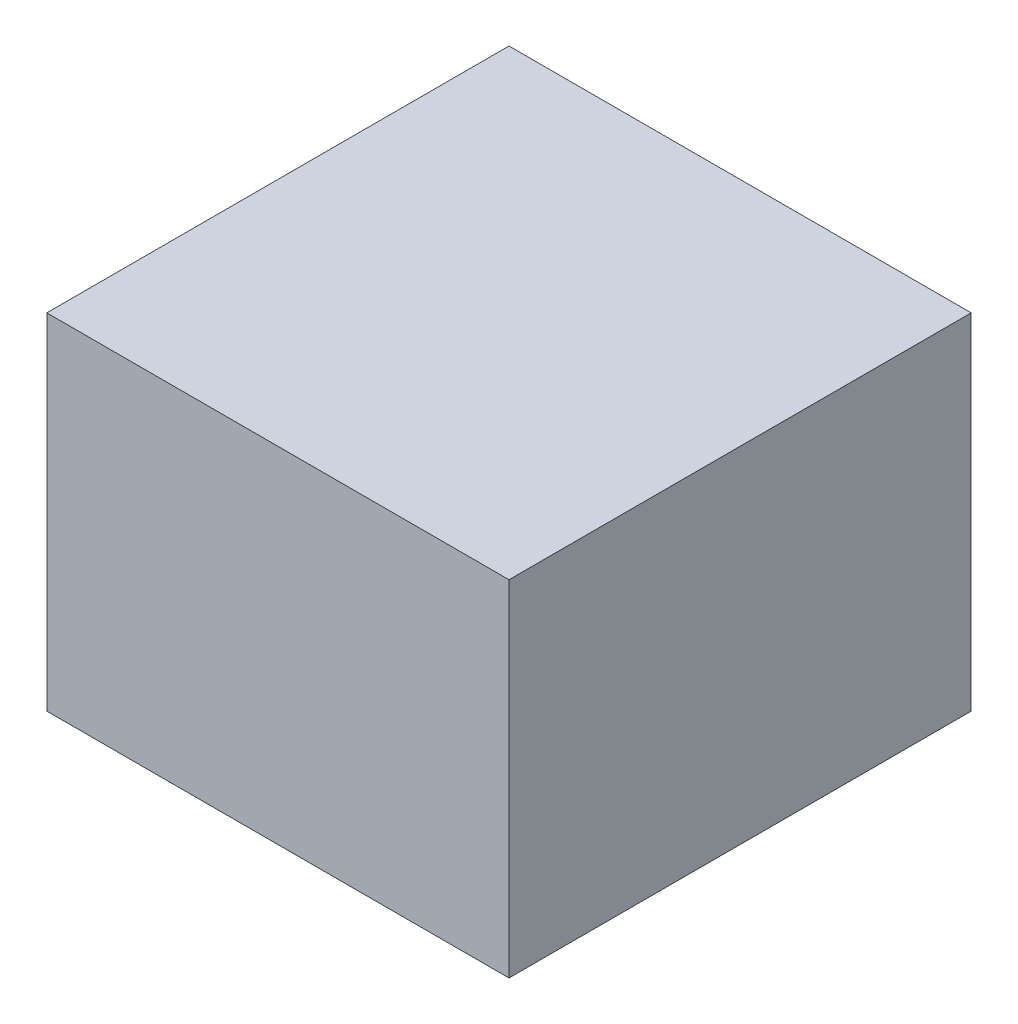
ISO-10303-21;
HEADER;
FILE_DESCRIPTION(('STEP AP214'),'2;1');
FILE_NAME('part.step','',(''),(''),'','','');
FILE_SCHEMA(('AUTOMOTIVE_DESIGN { 1 0 10303 214 1 1 1 1 }'));
ENDSEC;
DATA;
#1=APPLICATION_CONTEXT('core data for automotive mechanical design processes');
#2=APPLICATION_PROTOCOL_DEFINITION('international standard','automotive_design',2000,#1);
#3=PRODUCT_CONTEXT('',#1,'mechanical');
#4=PRODUCT('Part','Part','',(#3));
#5=PRODUCT_RELATED_PRODUCT_CATEGORY('part','',(#4));
#6=PRODUCT_DEFINITION_FORMATION('','',#4);
#7=PRODUCT_DEFINITION_CONTEXT('part definition',#1,'design');
#8=PRODUCT_DEFINITION('design','',#6,#7);
#9=PRODUCT_DEFINITION_SHAPE('','',#8);
#10=(LENGTH_UNIT() NAMED_UNIT(*) SI_UNIT(.MILLI.,.METRE.));
#11=(NAMED_UNIT(*) PLANE_ANGLE_UNIT() SI_UNIT($,.RADIAN.));
#12=(NAMED_UNIT(*) SI_UNIT($,.STERADIAN.) SOLID_ANGLE_UNIT());
#13=UNCERTAINTY_MEASURE_WITH_UNIT(LENGTH_MEASURE(1.E-05),#10,'distance_accuracy_value','');
#14=(GEOMETRIC_REPRESENTATION_CONTEXT(3) GLOBAL_UNCERTAINTY_ASSIGNED_CONTEXT((#13)) GLOBAL_UNIT_ASSIGNED_CONTEXT((#10,
#11,#12)) REPRESENTATION_CONTEXT('',''));
#15=CARTESIAN_POINT('',(0.,0.,0.));
#16=DIRECTION('',(0.,0.,1.));
#17=DIRECTION('',(1.,0.,0.));
#18=AXIS2_PLACEMENT_3D('',#15,#16,#17);
#19=CARTESIAN_POINT('',(0.,0.,0.));
#20=DIRECTION('',(0.,-1.,0.));
#21=DIRECTION('',(0.,0.,-1.));
#22=AXIS2_PLACEMENT_3D('',#19,#20,#21);
#23=PLANE('',#22);
#24=DIRECTION('',(0.,0.,-1.));
#25=VECTOR('',#24,1.);
#26=CARTESIAN_POINT('',(6.7,0.,-6.7));
#27=LINE('',#26,#25);
#28=CARTESIAN_POINT('',(6.7,0.,6.7));
#29=VERTEX_POINT('',#28);
#30=CARTESIAN_POINT('',(6.7,0.,-6.7));
#31=VERTEX_POINT('',#30);
#32=EDGE_CURVE('E119',#29,#31,#27,.T.);
#33=ORIENTED_EDGE('',*,*,#32,.F.);
#34=DIRECTION('',(1.,0.,0.));
#35=VECTOR('',#34,1.);
#36=CARTESIAN_POINT('',(0.,0.,6.7));
#37=LINE('',#36,#35);
#38=CARTESIAN_POINT('',(-6.7,0.,6.7));
#39=VERTEX_POINT('',#38);
#40=EDGE_CURVE('E89',#39,#29,#37,.T.);
#41=ORIENTED_EDGE('',*,*,#40,.F.);
#42=DIRECTION('',(0.,0.,1.));
#43=VECTOR('',#42,1.);
#44=CARTESIAN_POINT('',(-6.7,0.,6.7));
#45=LINE('',#44,#43);
#46=CARTESIAN_POINT('',(-6.7,0.,-6.7));
#47=VERTEX_POINT('',#46);
#48=EDGE_CURVE('E55',#47,#39,#45,.T.);
#49=ORIENTED_EDGE('',*,*,#48,.F.);
#50=DIRECTION('',(-1.,0.,0.));
#51=VECTOR('',#50,1.);
#52=CARTESIAN_POINT('',(-6.7,0.,-6.7));
#53=LINE('',#52,#51);
#54=EDGE_CURVE('E63',#31,#47,#53,.T.);
#55=ORIENTED_EDGE('',*,*,#54,.F.);
#56=EDGE_LOOP('',(#33,#41,#49,#55));
#57=FACE_BOUND('',#56,.T.);
#58=CARTESIAN_POINT('',(0.,0.,0.));
#59=DIRECTION('',(0.,1.,0.));
#60=DIRECTION('',(0.,0.,1.));
#61=AXIS2_PLACEMENT_3D('',#58,#59,#60);
#62=CIRCLE('',#61,4.7);
#63=CARTESIAN_POINT('',(0.,0.,4.7));
#64=VERTEX_POINT('',#63);
#65=EDGE_CURVE('E115',#64,#64,#62,.T.);
#66=ORIENTED_EDGE('',*,*,#65,.T.);
#67=EDGE_LOOP('',(#66));
#68=FACE_BOUND('',#67,.T.);
#69=ADVANCED_FACE('F39',(#57,#68),#23,.T.);
#70=CARTESIAN_POINT('',(6.7,6.,-6.7));
#71=DIRECTION('',(-1.,0.,0.));
#72=DIRECTION('',(0.,0.,1.));
#73=AXIS2_PLACEMENT_3D('',#70,#71,#72);
#74=PLANE('',#73);
#75=ORIENTED_EDGE('',*,*,#32,.T.);
#76=DIRECTION('',(0.,-1.,0.));
#77=VECTOR('',#76,1.);
#78=CARTESIAN_POINT('',(6.7,6.,-6.7));
#79=LINE('',#78,#77);
#80=CARTESIAN_POINT('',(6.7,10.,-6.7));
#81=VERTEX_POINT('',#80);
#82=EDGE_CURVE('E48',#81,#31,#79,.T.);
#83=ORIENTED_EDGE('',*,*,#82,.F.);
#84=DIRECTION('',(0.,0.,-1.));
#85=VECTOR('',#84,1.);
#86=CARTESIAN_POINT('',(6.7,10.,6.7));
#87=LINE('',#86,#85);
#88=CARTESIAN_POINT('',(6.7,10.,6.7));
#89=VERTEX_POINT('',#88);
#90=EDGE_CURVE('E98',#89,#81,#87,.T.);
#91=ORIENTED_EDGE('',*,*,#90,.F.);
#92=DIRECTION('',(0.,-1.,0.));
#93=VECTOR('',#92,1.);
#94=CARTESIAN_POINT('',(6.7,6.,6.7));
#95=LINE('',#94,#93);
#96=EDGE_CURVE('E11',#89,#29,#95,.T.);
#97=ORIENTED_EDGE('',*,*,#96,.T.);
#98=EDGE_LOOP('',(#75,#83,#91,#97));
#99=FACE_BOUND('',#98,.T.);
#100=ADVANCED_FACE('F41',(#99),#74,.F.);
#101=CARTESIAN_POINT('',(-6.7,6.,-6.7));
#102=DIRECTION('',(0.,0.,1.));
#103=DIRECTION('',(1.,0.,0.));
#104=AXIS2_PLACEMENT_3D('',#101,#102,#103);
#105=PLANE('',#104);
#106=ORIENTED_EDGE('',*,*,#54,.T.);
#107=DIRECTION('',(0.,-1.,0.));
#108=VECTOR('',#107,1.);
#109=CARTESIAN_POINT('',(-6.7,6.,-6.7));
#110=LINE('',#109,#108);
#111=CARTESIAN_POINT('',(-6.7,10.,-6.7));
#112=VERTEX_POINT('',#111);
#113=EDGE_CURVE('E88',#112,#47,#110,.T.);
#114=ORIENTED_EDGE('',*,*,#113,.F.);
#115=DIRECTION('',(-1.,0.,0.));
#116=VECTOR('',#115,1.);
#117=CARTESIAN_POINT('',(-6.7,10.,-6.7));
#118=LINE('',#117,#116);
#119=EDGE_CURVE('E103',#81,#112,#118,.T.);
#120=ORIENTED_EDGE('',*,*,#119,.F.);
#121=ORIENTED_EDGE('',*,*,#82,.T.);
#122=EDGE_LOOP('',(#106,#114,#120,#121));
#123=FACE_BOUND('',#122,.T.);
#124=ADVANCED_FACE('F130',(#123),#105,.F.);
#125=CARTESIAN_POINT('',(-6.7,6.,6.7));
#126=DIRECTION('',(1.,0.,0.));
#127=DIRECTION('',(0.,0.,-1.));
#128=AXIS2_PLACEMENT_3D('',#125,#126,#127);
#129=PLANE('',#128);
#130=ORIENTED_EDGE('',*,*,#48,.T.);
#131=DIRECTION('',(0.,-1.,0.));
#132=VECTOR('',#131,1.);
#133=CARTESIAN_POINT('',(-6.7,6.,6.7));
#134=LINE('',#133,#132);
#135=CARTESIAN_POINT('',(-6.7,10.,6.7));
#136=VERTEX_POINT('',#135);
#137=EDGE_CURVE('E80',#136,#39,#134,.T.);
#138=ORIENTED_EDGE('',*,*,#137,.F.);
#139=DIRECTION('',(0.,0.,1.));
#140=VECTOR('',#139,1.);
#141=CARTESIAN_POINT('',(-6.7,10.,6.7));
#142=LINE('',#141,#140);
#143=EDGE_CURVE('E84',#112,#136,#142,.T.);
#144=ORIENTED_EDGE('',*,*,#143,.F.);
#145=ORIENTED_EDGE('',*,*,#113,.T.);
#146=EDGE_LOOP('',(#130,#138,#144,#145));
#147=FACE_BOUND('',#146,.T.);
#148=ADVANCED_FACE('F82',(#147),#129,.F.);
#149=CARTESIAN_POINT('',(0.,6.,6.7));
#150=DIRECTION('',(0.,0.,-1.));
#151=DIRECTION('',(-1.,0.,0.));
#152=AXIS2_PLACEMENT_3D('',#149,#150,#151);
#153=PLANE('',#152);
#154=ORIENTED_EDGE('',*,*,#40,.T.);
#155=ORIENTED_EDGE('',*,*,#96,.F.);
#156=DIRECTION('',(1.,0.,0.));
#157=VECTOR('',#156,1.);
#158=CARTESIAN_POINT('',(-6.7,10.,6.7));
#159=LINE('',#158,#157);
#160=EDGE_CURVE('E92',#136,#89,#159,.T.);
#161=ORIENTED_EDGE('',*,*,#160,.F.);
#162=ORIENTED_EDGE('',*,*,#137,.T.);
#163=EDGE_LOOP('',(#154,#155,#161,#162));
#164=FACE_BOUND('',#163,.T.);
#165=ADVANCED_FACE('F93',(#164),#153,.F.);
#166=CARTESIAN_POINT('',(0.,6.,0.));
#167=DIRECTION('',(0.,-1.,0.));
#168=DIRECTION('',(0.,0.,-1.));
#169=AXIS2_PLACEMENT_3D('',#166,#167,#168);
#170=CYLINDRICAL_SURFACE('',#169,4.7);
#171=CARTESIAN_POINT('',(0.,6.,0.));
#172=DIRECTION('',(0.,1.,0.));
#173=DIRECTION('',(0.,0.,1.));
#174=AXIS2_PLACEMENT_3D('',#171,#172,#173);
#175=CIRCLE('',#174,4.7);
#176=CARTESIAN_POINT('',(0.,6.,4.7));
#177=VERTEX_POINT('',#176);
#178=EDGE_CURVE('E111',#177,#177,#175,.T.);
#179=ORIENTED_EDGE('',*,*,#178,.T.);
#180=EDGE_LOOP('',(#179));
#181=FACE_BOUND('',#180,.T.);
#182=ORIENTED_EDGE('',*,*,#65,.F.);
#183=EDGE_LOOP('',(#182));
#184=FACE_BOUND('',#183,.T.);
#185=ADVANCED_FACE('F145',(#181,#184),#170,.F.);
#186=CARTESIAN_POINT('',(0.,6.,0.));
#187=DIRECTION('',(0.,-1.,0.));
#188=DIRECTION('',(0.,0.,-1.));
#189=AXIS2_PLACEMENT_3D('',#186,#187,#188);
#190=PLANE('',#189);
#191=ORIENTED_EDGE('',*,*,#178,.F.);
#192=EDGE_LOOP('',(#191));
#193=FACE_BOUND('',#192,.T.);
#194=ADVANCED_FACE('F165',(#193),#190,.T.);
#195=CARTESIAN_POINT('',(0.,10.,0.));
#196=DIRECTION('',(0.,-1.,0.));
#197=DIRECTION('',(0.,0.,-1.));
#198=AXIS2_PLACEMENT_3D('',#195,#196,#197);
#199=PLANE('',#198);
#200=ORIENTED_EDGE('',*,*,#143,.T.);
#201=ORIENTED_EDGE('',*,*,#160,.T.);
#202=ORIENTED_EDGE('',*,*,#90,.T.);
#203=ORIENTED_EDGE('',*,*,#119,.T.);
#204=EDGE_LOOP('',(#200,#201,#202,#203));
#205=FACE_BOUND('',#204,.T.);
#206=ADVANCED_FACE('F101',(#205),#199,.F.);
#207=CLOSED_SHELL('',(#69,#100,#124,#148,#165,#185,#194,#206));
#208=MANIFOLD_SOLID_BREP('B2',#207);
#209=ADVANCED_BREP_SHAPE_REPRESENTATION('',(#18,#208),#14);
#210=SHAPE_DEFINITION_REPRESENTATION(#9,#209);
ENDSEC;
END-ISO-10303-21;
